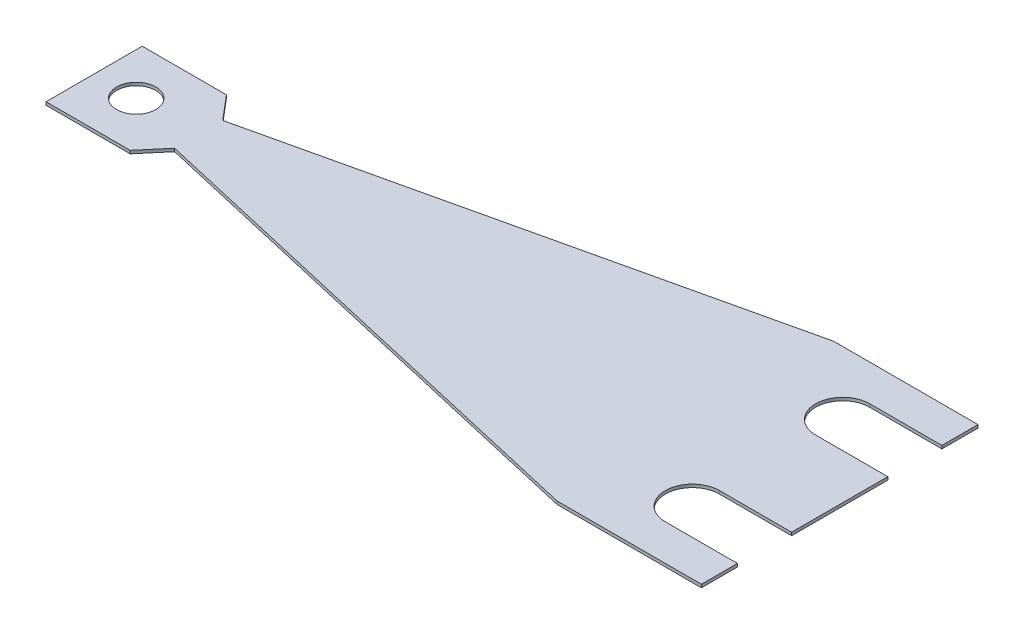
ISO-10303-21;
HEADER;
FILE_DESCRIPTION(('STEP AP214'),'2;1');
FILE_NAME('part.step','',(''),(''),'','','');
FILE_SCHEMA(('AUTOMOTIVE_DESIGN { 1 0 10303 214 1 1 1 1 }'));
ENDSEC;
DATA;
#1=APPLICATION_CONTEXT('core data for automotive mechanical design processes');
#2=APPLICATION_PROTOCOL_DEFINITION('international standard','automotive_design',2000,#1);
#3=PRODUCT_CONTEXT('',#1,'mechanical');
#4=PRODUCT('Part','Part','',(#3));
#5=PRODUCT_RELATED_PRODUCT_CATEGORY('part','',(#4));
#6=PRODUCT_DEFINITION_FORMATION('','',#4);
#7=PRODUCT_DEFINITION_CONTEXT('part definition',#1,'design');
#8=PRODUCT_DEFINITION('design','',#6,#7);
#9=PRODUCT_DEFINITION_SHAPE('','',#8);
#10=(LENGTH_UNIT() NAMED_UNIT(*) SI_UNIT(.MILLI.,.METRE.));
#11=(NAMED_UNIT(*) PLANE_ANGLE_UNIT() SI_UNIT($,.RADIAN.));
#12=(NAMED_UNIT(*) SI_UNIT($,.STERADIAN.) SOLID_ANGLE_UNIT());
#13=UNCERTAINTY_MEASURE_WITH_UNIT(LENGTH_MEASURE(1.E-05),#10,'distance_accuracy_value','');
#14=(GEOMETRIC_REPRESENTATION_CONTEXT(3) GLOBAL_UNCERTAINTY_ASSIGNED_CONTEXT((#13)) GLOBAL_UNIT_ASSIGNED_CONTEXT((#10,
#11,#12)) REPRESENTATION_CONTEXT('',''));
#15=CARTESIAN_POINT('',(0.,0.,0.));
#16=DIRECTION('',(0.,0.,1.));
#17=DIRECTION('',(1.,0.,0.));
#18=AXIS2_PLACEMENT_3D('',#15,#16,#17);
#19=CARTESIAN_POINT('',(0.,0.254,11.5));
#20=DIRECTION('',(-1.,0.,0.));
#21=DIRECTION('',(0.,0.,1.));
#22=AXIS2_PLACEMENT_3D('',#19,#20,#21);
#23=PLANE('',#22);
#24=DIRECTION('',(0.,0.,-1.));
#25=VECTOR('',#24,1.);
#26=CARTESIAN_POINT('',(0.,0.254,11.5));
#27=LINE('',#26,#25);
#28=CARTESIAN_POINT('',(0.,0.254,4.));
#29=VERTEX_POINT('',#28);
#30=CARTESIAN_POINT('',(0.,0.254,-4.));
#31=VERTEX_POINT('',#30);
#32=EDGE_CURVE('E247',#29,#31,#27,.T.);
#33=ORIENTED_EDGE('',*,*,#32,.F.);
#34=DIRECTION('',(0.,1.,0.));
#35=VECTOR('',#34,1.);
#36=CARTESIAN_POINT('',(0.,0.,4.));
#37=LINE('',#36,#35);
#38=CARTESIAN_POINT('',(0.,0.,4.));
#39=VERTEX_POINT('',#38);
#40=EDGE_CURVE('E193',#39,#29,#37,.T.);
#41=ORIENTED_EDGE('',*,*,#40,.F.);
#42=DIRECTION('',(0.,0.,-1.));
#43=VECTOR('',#42,1.);
#44=CARTESIAN_POINT('',(0.,0.,11.5));
#45=LINE('',#44,#43);
#46=CARTESIAN_POINT('',(0.,0.,-4.));
#47=VERTEX_POINT('',#46);
#48=EDGE_CURVE('E55',#39,#47,#45,.T.);
#49=ORIENTED_EDGE('',*,*,#48,.T.);
#50=DIRECTION('',(0.,1.,0.));
#51=VECTOR('',#50,1.);
#52=CARTESIAN_POINT('',(0.,0.,-4.));
#53=LINE('',#52,#51);
#54=EDGE_CURVE('E219',#47,#31,#53,.T.);
#55=ORIENTED_EDGE('',*,*,#54,.T.);
#56=EDGE_LOOP('',(#33,#41,#49,#55));
#57=FACE_BOUND('',#56,.T.);
#58=ADVANCED_FACE('F32',(#57),#23,.F.);
#59=CARTESIAN_POINT('',(0.,0.254,-8.5));
#60=VERTEX_POINT('',#59);
#61=CARTESIAN_POINT('',(0.,0.254,-11.5));
#62=VERTEX_POINT('',#61);
#63=EDGE_CURVE('E242',#60,#62,#27,.T.);
#64=ORIENTED_EDGE('',*,*,#63,.F.);
#65=DIRECTION('',(0.,1.,0.));
#66=VECTOR('',#65,1.);
#67=CARTESIAN_POINT('',(0.,0.,-8.5));
#68=LINE('',#67,#66);
#69=CARTESIAN_POINT('',(0.,0.,-8.5));
#70=VERTEX_POINT('',#69);
#71=EDGE_CURVE('E217',#70,#60,#68,.T.);
#72=ORIENTED_EDGE('',*,*,#71,.F.);
#73=CARTESIAN_POINT('',(0.,0.,-11.5));
#74=VERTEX_POINT('',#73);
#75=EDGE_CURVE('E266',#70,#74,#45,.T.);
#76=ORIENTED_EDGE('',*,*,#75,.T.);
#77=DIRECTION('',(0.,-1.,0.));
#78=VECTOR('',#77,1.);
#79=CARTESIAN_POINT('',(0.,0.254,-11.5));
#80=LINE('',#79,#78);
#81=EDGE_CURVE('E246',#62,#74,#80,.T.);
#82=ORIENTED_EDGE('',*,*,#81,.F.);
#83=EDGE_LOOP('',(#64,#72,#76,#82));
#84=FACE_BOUND('',#83,.T.);
#85=ADVANCED_FACE('F324',(#84),#23,.F.);
#86=CARTESIAN_POINT('',(0.,0.254,-11.5));
#87=DIRECTION('',(0.,0.,1.));
#88=DIRECTION('',(1.,0.,0.));
#89=AXIS2_PLACEMENT_3D('',#86,#87,#88);
#90=PLANE('',#89);
#91=DIRECTION('',(-1.,0.,0.));
#92=VECTOR('',#91,1.);
#93=CARTESIAN_POINT('',(0.,0.,-11.5));
#94=LINE('',#93,#92);
#95=CARTESIAN_POINT('',(-12.,0.,-11.5));
#96=VERTEX_POINT('',#95);
#97=EDGE_CURVE('E216',#74,#96,#94,.T.);
#98=ORIENTED_EDGE('',*,*,#97,.T.);
#99=DIRECTION('',(0.,-1.,0.));
#100=VECTOR('',#99,1.);
#101=CARTESIAN_POINT('',(-12.,0.254,-11.5));
#102=LINE('',#101,#100);
#103=CARTESIAN_POINT('',(-12.,0.254,-11.5));
#104=VERTEX_POINT('',#103);
#105=EDGE_CURVE('E11',#104,#96,#102,.T.);
#106=ORIENTED_EDGE('',*,*,#105,.F.);
#107=DIRECTION('',(-1.,0.,0.));
#108=VECTOR('',#107,1.);
#109=CARTESIAN_POINT('',(0.,0.254,-11.5));
#110=LINE('',#109,#108);
#111=EDGE_CURVE('E222',#62,#104,#110,.T.);
#112=ORIENTED_EDGE('',*,*,#111,.F.);
#113=ORIENTED_EDGE('',*,*,#81,.T.);
#114=EDGE_LOOP('',(#98,#106,#112,#113));
#115=FACE_BOUND('',#114,.T.);
#116=ADVANCED_FACE('F34',(#115),#90,.F.);
#117=CARTESIAN_POINT('',(-12.,0.254,-11.5));
#118=DIRECTION('',(0.224147692921427,0.,0.974555186614899));
#119=DIRECTION('',(0.9745551866149,0.,-0.224147692921427));
#120=AXIS2_PLACEMENT_3D('',#117,#118,#119);
#121=PLANE('',#120);
#122=DIRECTION('',(-0.9745551866149,0.,0.224147692921427));
#123=VECTOR('',#122,1.);
#124=CARTESIAN_POINT('',(-12.,0.,-11.5));
#125=LINE('',#124,#123);
#126=CARTESIAN_POINT('',(-53.304347826087,0.,-2.));
#127=VERTEX_POINT('',#126);
#128=EDGE_CURVE('E250',#96,#127,#125,.T.);
#129=ORIENTED_EDGE('',*,*,#128,.T.);
#130=DIRECTION('',(0.,-1.,0.));
#131=VECTOR('',#130,1.);
#132=CARTESIAN_POINT('',(-53.304347826087,0.254,-2.));
#133=LINE('',#132,#131);
#134=CARTESIAN_POINT('',(-53.304347826087,0.254,-2.));
#135=VERTEX_POINT('',#134);
#136=EDGE_CURVE('E40',#135,#127,#133,.T.);
#137=ORIENTED_EDGE('',*,*,#136,.F.);
#138=DIRECTION('',(-0.9745551866149,0.,0.224147692921427));
#139=VECTOR('',#138,1.);
#140=CARTESIAN_POINT('',(-12.,0.254,-11.5));
#141=LINE('',#140,#139);
#142=EDGE_CURVE('E225',#104,#135,#141,.T.);
#143=ORIENTED_EDGE('',*,*,#142,.F.);
#144=ORIENTED_EDGE('',*,*,#105,.T.);
#145=EDGE_LOOP('',(#129,#137,#143,#144));
#146=FACE_BOUND('',#145,.T.);
#147=ADVANCED_FACE('F317',(#146),#121,.F.);
#148=CARTESIAN_POINT('',(-53.304347826087,0.254,-2.));
#149=DIRECTION('',(-0.762756963467113,0.,0.64668525163516));
#150=DIRECTION('',(0.64668525163516,0.,0.762756963467113));
#151=AXIS2_PLACEMENT_3D('',#148,#149,#150);
#152=PLANE('',#151);
#153=DIRECTION('',(-0.64668525163516,0.,-0.762756963467113));
#154=VECTOR('',#153,1.);
#155=CARTESIAN_POINT('',(-53.304347826087,0.,-2.));
#156=LINE('',#155,#154);
#157=CARTESIAN_POINT('',(-55.,0.,-4.));
#158=VERTEX_POINT('',#157);
#159=EDGE_CURVE('E252',#127,#158,#156,.T.);
#160=ORIENTED_EDGE('',*,*,#159,.T.);
#161=DIRECTION('',(0.,-1.,0.));
#162=VECTOR('',#161,1.);
#163=CARTESIAN_POINT('',(-55.,0.254,-4.));
#164=LINE('',#163,#162);
#165=CARTESIAN_POINT('',(-55.,0.254,-4.));
#166=VERTEX_POINT('',#165);
#167=EDGE_CURVE('E288',#166,#158,#164,.T.);
#168=ORIENTED_EDGE('',*,*,#167,.F.);
#169=DIRECTION('',(-0.64668525163516,0.,-0.762756963467113));
#170=VECTOR('',#169,1.);
#171=CARTESIAN_POINT('',(-53.304347826087,0.254,-2.));
#172=LINE('',#171,#170);
#173=EDGE_CURVE('E228',#135,#166,#172,.T.);
#174=ORIENTED_EDGE('',*,*,#173,.F.);
#175=ORIENTED_EDGE('',*,*,#136,.T.);
#176=EDGE_LOOP('',(#160,#168,#174,#175));
#177=FACE_BOUND('',#176,.T.);
#178=ADVANCED_FACE('F295',(#177),#152,.F.);
#179=CARTESIAN_POINT('',(-55.,0.254,-4.));
#180=DIRECTION('',(0.,0.,1.));
#181=DIRECTION('',(1.,0.,0.));
#182=AXIS2_PLACEMENT_3D('',#179,#180,#181);
#183=PLANE('',#182);
#184=DIRECTION('',(-1.,0.,0.));
#185=VECTOR('',#184,1.);
#186=CARTESIAN_POINT('',(-55.,0.,-4.));
#187=LINE('',#186,#185);
#188=CARTESIAN_POINT('',(-62.,0.,-4.));
#189=VERTEX_POINT('',#188);
#190=EDGE_CURVE('E254',#158,#189,#187,.T.);
#191=ORIENTED_EDGE('',*,*,#190,.T.);
#192=DIRECTION('',(0.,-1.,0.));
#193=VECTOR('',#192,1.);
#194=CARTESIAN_POINT('',(-62.,0.254,-4.));
#195=LINE('',#194,#193);
#196=CARTESIAN_POINT('',(-62.,0.254,-4.));
#197=VERTEX_POINT('',#196);
#198=EDGE_CURVE('E285',#197,#189,#195,.T.);
#199=ORIENTED_EDGE('',*,*,#198,.F.);
#200=DIRECTION('',(-1.,0.,0.));
#201=VECTOR('',#200,1.);
#202=CARTESIAN_POINT('',(-55.,0.254,-4.));
#203=LINE('',#202,#201);
#204=EDGE_CURVE('E230',#166,#197,#203,.T.);
#205=ORIENTED_EDGE('',*,*,#204,.F.);
#206=ORIENTED_EDGE('',*,*,#167,.T.);
#207=EDGE_LOOP('',(#191,#199,#205,#206));
#208=FACE_BOUND('',#207,.T.);
#209=ADVANCED_FACE('F304',(#208),#183,.F.);
#210=CARTESIAN_POINT('',(-62.,0.254,-4.));
#211=DIRECTION('',(1.,0.,0.));
#212=DIRECTION('',(0.,0.,-1.));
#213=AXIS2_PLACEMENT_3D('',#210,#211,#212);
#214=PLANE('',#213);
#215=DIRECTION('',(0.,0.,1.));
#216=VECTOR('',#215,1.);
#217=CARTESIAN_POINT('',(-62.,0.,-4.));
#218=LINE('',#217,#216);
#219=CARTESIAN_POINT('',(-62.,0.,4.));
#220=VERTEX_POINT('',#219);
#221=EDGE_CURVE('E256',#189,#220,#218,.T.);
#222=ORIENTED_EDGE('',*,*,#221,.T.);
#223=DIRECTION('',(0.,-1.,0.));
#224=VECTOR('',#223,1.);
#225=CARTESIAN_POINT('',(-62.,0.254,4.));
#226=LINE('',#225,#224);
#227=CARTESIAN_POINT('',(-62.,0.254,4.));
#228=VERTEX_POINT('',#227);
#229=EDGE_CURVE('E282',#228,#220,#226,.T.);
#230=ORIENTED_EDGE('',*,*,#229,.F.);
#231=DIRECTION('',(0.,0.,1.));
#232=VECTOR('',#231,1.);
#233=CARTESIAN_POINT('',(-62.,0.254,-4.));
#234=LINE('',#233,#232);
#235=EDGE_CURVE('E232',#197,#228,#234,.T.);
#236=ORIENTED_EDGE('',*,*,#235,.F.);
#237=ORIENTED_EDGE('',*,*,#198,.T.);
#238=EDGE_LOOP('',(#222,#230,#236,#237));
#239=FACE_BOUND('',#238,.T.);
#240=ADVANCED_FACE('F308',(#239),#214,.F.);
#241=CARTESIAN_POINT('',(-55.,0.254,4.));
#242=DIRECTION('',(0.,0.,-1.));
#243=DIRECTION('',(-1.,0.,0.));
#244=AXIS2_PLACEMENT_3D('',#241,#242,#243);
#245=PLANE('',#244);
#246=DIRECTION('',(1.,0.,0.));
#247=VECTOR('',#246,1.);
#248=CARTESIAN_POINT('',(-55.,0.,4.));
#249=LINE('',#248,#247);
#250=CARTESIAN_POINT('',(-55.,0.,4.));
#251=VERTEX_POINT('',#250);
#252=EDGE_CURVE('E258',#220,#251,#249,.T.);
#253=ORIENTED_EDGE('',*,*,#252,.T.);
#254=DIRECTION('',(0.,-1.,0.));
#255=VECTOR('',#254,1.);
#256=CARTESIAN_POINT('',(-55.,0.254,4.));
#257=LINE('',#256,#255);
#258=CARTESIAN_POINT('',(-55.,0.254,4.));
#259=VERTEX_POINT('',#258);
#260=EDGE_CURVE('E279',#259,#251,#257,.T.);
#261=ORIENTED_EDGE('',*,*,#260,.F.);
#262=DIRECTION('',(1.,0.,0.));
#263=VECTOR('',#262,1.);
#264=CARTESIAN_POINT('',(-55.,0.254,4.));
#265=LINE('',#264,#263);
#266=EDGE_CURVE('E234',#228,#259,#265,.T.);
#267=ORIENTED_EDGE('',*,*,#266,.F.);
#268=ORIENTED_EDGE('',*,*,#229,.T.);
#269=EDGE_LOOP('',(#253,#261,#267,#268));
#270=FACE_BOUND('',#269,.T.);
#271=ADVANCED_FACE('F382',(#270),#245,.F.);
#272=CARTESIAN_POINT('',(-53.304347826087,0.254,2.00000000000001));
#273=DIRECTION('',(-0.762756963467111,0.,-0.646685251635162));
#274=DIRECTION('',(-0.646685251635162,0.,0.762756963467111));
#275=AXIS2_PLACEMENT_3D('',#272,#273,#274);
#276=PLANE('',#275);
#277=DIRECTION('',(0.646685251635162,0.,-0.76275696346711));
#278=VECTOR('',#277,1.);
#279=CARTESIAN_POINT('',(-53.304347826087,0.,2.00000000000001));
#280=LINE('',#279,#278);
#281=CARTESIAN_POINT('',(-53.304347826087,0.,2.00000000000001));
#282=VERTEX_POINT('',#281);
#283=EDGE_CURVE('E260',#251,#282,#280,.T.);
#284=ORIENTED_EDGE('',*,*,#283,.T.);
#285=DIRECTION('',(0.,-1.,0.));
#286=VECTOR('',#285,1.);
#287=CARTESIAN_POINT('',(-53.304347826087,0.254,2.00000000000001));
#288=LINE('',#287,#286);
#289=CARTESIAN_POINT('',(-53.304347826087,0.254,2.00000000000001));
#290=VERTEX_POINT('',#289);
#291=EDGE_CURVE('E276',#290,#282,#288,.T.);
#292=ORIENTED_EDGE('',*,*,#291,.F.);
#293=DIRECTION('',(0.646685251635162,0.,-0.76275696346711));
#294=VECTOR('',#293,1.);
#295=CARTESIAN_POINT('',(-53.304347826087,0.254,2.00000000000001));
#296=LINE('',#295,#294);
#297=EDGE_CURVE('E236',#259,#290,#296,.T.);
#298=ORIENTED_EDGE('',*,*,#297,.F.);
#299=ORIENTED_EDGE('',*,*,#260,.T.);
#300=EDGE_LOOP('',(#284,#292,#298,#299));
#301=FACE_BOUND('',#300,.T.);
#302=ADVANCED_FACE('F380',(#301),#276,.F.);
#303=CARTESIAN_POINT('',(-12.,0.254,11.5));
#304=DIRECTION('',(0.224147692921427,0.,-0.974555186614899));
#305=DIRECTION('',(-0.9745551866149,0.,-0.224147692921427));
#306=AXIS2_PLACEMENT_3D('',#303,#304,#305);
#307=PLANE('',#306);
#308=DIRECTION('',(0.9745551866149,0.,0.224147692921427));
#309=VECTOR('',#308,1.);
#310=CARTESIAN_POINT('',(-12.,0.,11.5));
#311=LINE('',#310,#309);
#312=CARTESIAN_POINT('',(-12.,0.,11.5));
#313=VERTEX_POINT('',#312);
#314=EDGE_CURVE('E262',#282,#313,#311,.T.);
#315=ORIENTED_EDGE('',*,*,#314,.T.);
#316=DIRECTION('',(0.,-1.,0.));
#317=VECTOR('',#316,1.);
#318=CARTESIAN_POINT('',(-12.,0.254,11.5));
#319=LINE('',#318,#317);
#320=CARTESIAN_POINT('',(-12.,0.254,11.5));
#321=VERTEX_POINT('',#320);
#322=EDGE_CURVE('E273',#321,#313,#319,.T.);
#323=ORIENTED_EDGE('',*,*,#322,.F.);
#324=DIRECTION('',(0.9745551866149,0.,0.224147692921427));
#325=VECTOR('',#324,1.);
#326=CARTESIAN_POINT('',(-12.,0.254,11.5));
#327=LINE('',#326,#325);
#328=EDGE_CURVE('E238',#290,#321,#327,.T.);
#329=ORIENTED_EDGE('',*,*,#328,.F.);
#330=ORIENTED_EDGE('',*,*,#291,.T.);
#331=EDGE_LOOP('',(#315,#323,#329,#330));
#332=FACE_BOUND('',#331,.T.);
#333=ADVANCED_FACE('F366',(#332),#307,.F.);
#334=CARTESIAN_POINT('',(0.,0.254,11.5));
#335=DIRECTION('',(0.,0.,-1.));
#336=DIRECTION('',(-1.,0.,0.));
#337=AXIS2_PLACEMENT_3D('',#334,#335,#336);
#338=PLANE('',#337);
#339=DIRECTION('',(1.,0.,0.));
#340=VECTOR('',#339,1.);
#341=CARTESIAN_POINT('',(0.,0.,11.5));
#342=LINE('',#341,#340);
#343=CARTESIAN_POINT('',(0.,0.,11.5));
#344=VERTEX_POINT('',#343);
#345=EDGE_CURVE('E264',#313,#344,#342,.T.);
#346=ORIENTED_EDGE('',*,*,#345,.T.);
#347=DIRECTION('',(0.,-1.,0.));
#348=VECTOR('',#347,1.);
#349=CARTESIAN_POINT('',(0.,0.254,11.5));
#350=LINE('',#349,#348);
#351=CARTESIAN_POINT('',(0.,0.254,11.5));
#352=VERTEX_POINT('',#351);
#353=EDGE_CURVE('E270',#352,#344,#350,.T.);
#354=ORIENTED_EDGE('',*,*,#353,.F.);
#355=DIRECTION('',(1.,0.,0.));
#356=VECTOR('',#355,1.);
#357=CARTESIAN_POINT('',(0.,0.254,11.5));
#358=LINE('',#357,#356);
#359=EDGE_CURVE('E240',#321,#352,#358,.T.);
#360=ORIENTED_EDGE('',*,*,#359,.F.);
#361=ORIENTED_EDGE('',*,*,#322,.T.);
#362=EDGE_LOOP('',(#346,#354,#360,#361));
#363=FACE_BOUND('',#362,.T.);
#364=ADVANCED_FACE('F358',(#363),#338,.F.);
#365=CARTESIAN_POINT('',(0.,0.,8.5));
#366=VERTEX_POINT('',#365);
#367=EDGE_CURVE('E226',#344,#366,#45,.T.);
#368=ORIENTED_EDGE('',*,*,#367,.T.);
#369=DIRECTION('',(0.,1.,0.));
#370=VECTOR('',#369,1.);
#371=CARTESIAN_POINT('',(0.,0.,8.5));
#372=LINE('',#371,#370);
#373=CARTESIAN_POINT('',(0.,0.254,8.5));
#374=VERTEX_POINT('',#373);
#375=EDGE_CURVE('E47',#366,#374,#372,.T.);
#376=ORIENTED_EDGE('',*,*,#375,.T.);
#377=EDGE_CURVE('E243',#352,#374,#27,.T.);
#378=ORIENTED_EDGE('',*,*,#377,.F.);
#379=ORIENTED_EDGE('',*,*,#353,.T.);
#380=EDGE_LOOP('',(#368,#376,#378,#379));
#381=FACE_BOUND('',#380,.T.);
#382=ADVANCED_FACE('F351',(#381),#23,.F.);
#383=CARTESIAN_POINT('',(-62.,0.254,-11.5));
#384=DIRECTION('',(0.,1.,0.));
#385=DIRECTION('',(0.,0.,1.));
#386=AXIS2_PLACEMENT_3D('',#383,#384,#385);
#387=PLANE('',#386);
#388=CARTESIAN_POINT('',(-58.5,0.254,0.));
#389=DIRECTION('',(0.,1.,0.));
#390=DIRECTION('',(0.,0.,1.));
#391=AXIS2_PLACEMENT_3D('',#388,#389,#390);
#392=CIRCLE('',#391,1.63);
#393=CARTESIAN_POINT('',(-58.5,0.254,1.63));
#394=VERTEX_POINT('',#393);
#395=EDGE_CURVE('E183',#394,#394,#392,.T.);
#396=ORIENTED_EDGE('',*,*,#395,.F.);
#397=EDGE_LOOP('',(#396));
#398=FACE_BOUND('',#397,.T.);
#399=DIRECTION('',(-1.,0.,0.));
#400=VECTOR('',#399,1.);
#401=CARTESIAN_POINT('',(-6.,0.254,4.));
#402=LINE('',#401,#400);
#403=CARTESIAN_POINT('',(-6.,0.254,4.));
#404=VERTEX_POINT('',#403);
#405=EDGE_CURVE('E177',#29,#404,#402,.T.);
#406=ORIENTED_EDGE('',*,*,#405,.F.);
#407=ORIENTED_EDGE('',*,*,#32,.T.);
#408=DIRECTION('',(1.,0.,0.));
#409=VECTOR('',#408,1.);
#410=CARTESIAN_POINT('',(-6.,0.254,-4.));
#411=LINE('',#410,#409);
#412=CARTESIAN_POINT('',(-6.,0.254,-4.));
#413=VERTEX_POINT('',#412);
#414=EDGE_CURVE('E209',#413,#31,#411,.T.);
#415=ORIENTED_EDGE('',*,*,#414,.F.);
#416=CARTESIAN_POINT('',(-6.,0.254,-6.25));
#417=DIRECTION('',(0.,1.,0.));
#418=DIRECTION('',(0.,0.,1.));
#419=AXIS2_PLACEMENT_3D('',#416,#417,#418);
#420=CIRCLE('',#419,2.25);
#421=CARTESIAN_POINT('',(-6.,0.254,-8.5));
#422=VERTEX_POINT('',#421);
#423=EDGE_CURVE('E192',#422,#413,#420,.T.);
#424=ORIENTED_EDGE('',*,*,#423,.F.);
#425=DIRECTION('',(-1.,0.,0.));
#426=VECTOR('',#425,1.);
#427=CARTESIAN_POINT('',(0.,0.254,-8.5));
#428=LINE('',#427,#426);
#429=EDGE_CURVE('E200',#60,#422,#428,.T.);
#430=ORIENTED_EDGE('',*,*,#429,.F.);
#431=ORIENTED_EDGE('',*,*,#63,.T.);
#432=ORIENTED_EDGE('',*,*,#111,.T.);
#433=ORIENTED_EDGE('',*,*,#142,.T.);
#434=ORIENTED_EDGE('',*,*,#173,.T.);
#435=ORIENTED_EDGE('',*,*,#204,.T.);
#436=ORIENTED_EDGE('',*,*,#235,.T.);
#437=ORIENTED_EDGE('',*,*,#266,.T.);
#438=ORIENTED_EDGE('',*,*,#297,.T.);
#439=ORIENTED_EDGE('',*,*,#328,.T.);
#440=ORIENTED_EDGE('',*,*,#359,.T.);
#441=ORIENTED_EDGE('',*,*,#377,.T.);
#442=DIRECTION('',(1.,0.,0.));
#443=VECTOR('',#442,1.);
#444=CARTESIAN_POINT('',(0.,0.254,8.5));
#445=LINE('',#444,#443);
#446=CARTESIAN_POINT('',(-6.,0.254,8.5));
#447=VERTEX_POINT('',#446);
#448=EDGE_CURVE('E180',#447,#374,#445,.T.);
#449=ORIENTED_EDGE('',*,*,#448,.F.);
#450=CARTESIAN_POINT('',(-6.,0.254,6.25));
#451=DIRECTION('',(0.,1.,0.));
#452=DIRECTION('',(0.,0.,-1.));
#453=AXIS2_PLACEMENT_3D('',#450,#451,#452);
#454=CIRCLE('',#453,2.25);
#455=EDGE_CURVE('E166',#404,#447,#454,.T.);
#456=ORIENTED_EDGE('',*,*,#455,.F.);
#457=EDGE_LOOP('',(#406,#407,#415,#424,#430,#431,#432,#433,#434,#435,#436,#437,#438,#439,#440,
#441,#449,#456));
#458=FACE_BOUND('',#457,.T.);
#459=ADVANCED_FACE('F313',(#398,#458),#387,.T.);
#460=CARTESIAN_POINT('',(-62.,0.,-11.5));
#461=DIRECTION('',(0.,1.,0.));
#462=DIRECTION('',(0.,0.,1.));
#463=AXIS2_PLACEMENT_3D('',#460,#461,#462);
#464=PLANE('',#463);
#465=CARTESIAN_POINT('',(-58.5,0.,0.));
#466=DIRECTION('',(0.,1.,0.));
#467=DIRECTION('',(0.,0.,1.));
#468=AXIS2_PLACEMENT_3D('',#465,#466,#467);
#469=CIRCLE('',#468,1.63);
#470=CARTESIAN_POINT('',(-58.5,0.,1.63));
#471=VERTEX_POINT('',#470);
#472=EDGE_CURVE('E188',#471,#471,#469,.T.);
#473=ORIENTED_EDGE('',*,*,#472,.T.);
#474=EDGE_LOOP('',(#473));
#475=FACE_BOUND('',#474,.T.);
#476=ORIENTED_EDGE('',*,*,#48,.F.);
#477=DIRECTION('',(-1.,0.,0.));
#478=VECTOR('',#477,1.);
#479=CARTESIAN_POINT('',(-6.,0.,4.));
#480=LINE('',#479,#478);
#481=CARTESIAN_POINT('',(-6.,0.,4.));
#482=VERTEX_POINT('',#481);
#483=EDGE_CURVE('E168',#39,#482,#480,.T.);
#484=ORIENTED_EDGE('',*,*,#483,.T.);
#485=CARTESIAN_POINT('',(-6.,0.,6.25));
#486=DIRECTION('',(0.,1.,0.));
#487=DIRECTION('',(0.,0.,-1.));
#488=AXIS2_PLACEMENT_3D('',#485,#486,#487);
#489=CIRCLE('',#488,2.25);
#490=CARTESIAN_POINT('',(-6.,0.,8.5));
#491=VERTEX_POINT('',#490);
#492=EDGE_CURVE('E163',#482,#491,#489,.T.);
#493=ORIENTED_EDGE('',*,*,#492,.T.);
#494=DIRECTION('',(1.,0.,0.));
#495=VECTOR('',#494,1.);
#496=CARTESIAN_POINT('',(0.,0.,8.5));
#497=LINE('',#496,#495);
#498=EDGE_CURVE('E170',#491,#366,#497,.T.);
#499=ORIENTED_EDGE('',*,*,#498,.T.);
#500=ORIENTED_EDGE('',*,*,#367,.F.);
#501=ORIENTED_EDGE('',*,*,#345,.F.);
#502=ORIENTED_EDGE('',*,*,#314,.F.);
#503=ORIENTED_EDGE('',*,*,#283,.F.);
#504=ORIENTED_EDGE('',*,*,#252,.F.);
#505=ORIENTED_EDGE('',*,*,#221,.F.);
#506=ORIENTED_EDGE('',*,*,#190,.F.);
#507=ORIENTED_EDGE('',*,*,#159,.F.);
#508=ORIENTED_EDGE('',*,*,#128,.F.);
#509=ORIENTED_EDGE('',*,*,#97,.F.);
#510=ORIENTED_EDGE('',*,*,#75,.F.);
#511=DIRECTION('',(-1.,0.,0.));
#512=VECTOR('',#511,1.);
#513=CARTESIAN_POINT('',(0.,0.,-8.5));
#514=LINE('',#513,#512);
#515=CARTESIAN_POINT('',(-6.,0.,-8.5));
#516=VERTEX_POINT('',#515);
#517=EDGE_CURVE('E203',#70,#516,#514,.T.);
#518=ORIENTED_EDGE('',*,*,#517,.T.);
#519=CARTESIAN_POINT('',(-6.,0.,-6.25));
#520=DIRECTION('',(0.,1.,0.));
#521=DIRECTION('',(0.,0.,1.));
#522=AXIS2_PLACEMENT_3D('',#519,#520,#521);
#523=CIRCLE('',#522,2.25);
#524=CARTESIAN_POINT('',(-6.,0.,-4.));
#525=VERTEX_POINT('',#524);
#526=EDGE_CURVE('E196',#516,#525,#523,.T.);
#527=ORIENTED_EDGE('',*,*,#526,.T.);
#528=DIRECTION('',(1.,0.,0.));
#529=VECTOR('',#528,1.);
#530=CARTESIAN_POINT('',(-6.,0.,-4.));
#531=LINE('',#530,#529);
#532=EDGE_CURVE('E199',#525,#47,#531,.T.);
#533=ORIENTED_EDGE('',*,*,#532,.T.);
#534=EDGE_LOOP('',(#476,#484,#493,#499,#500,#501,#502,#503,#504,#505,#506,#507,#508,#509,#510,
#518,#527,#533));
#535=FACE_BOUND('',#534,.T.);
#536=ADVANCED_FACE('F176',(#475,#535),#464,.F.);
#537=CARTESIAN_POINT('',(-6.,0.,-6.25));
#538=DIRECTION('',(0.,1.,0.));
#539=DIRECTION('',(0.,0.,1.));
#540=AXIS2_PLACEMENT_3D('',#537,#538,#539);
#541=CYLINDRICAL_SURFACE('',#540,2.25);
#542=ORIENTED_EDGE('',*,*,#423,.T.);
#543=DIRECTION('',(0.,1.,0.));
#544=VECTOR('',#543,1.);
#545=CARTESIAN_POINT('',(-6.,0.,-4.));
#546=LINE('',#545,#544);
#547=EDGE_CURVE('E206',#525,#413,#546,.T.);
#548=ORIENTED_EDGE('',*,*,#547,.F.);
#549=ORIENTED_EDGE('',*,*,#526,.F.);
#550=DIRECTION('',(0.,1.,0.));
#551=VECTOR('',#550,1.);
#552=CARTESIAN_POINT('',(-6.,0.,-8.5));
#553=LINE('',#552,#551);
#554=EDGE_CURVE('E214',#516,#422,#553,.T.);
#555=ORIENTED_EDGE('',*,*,#554,.T.);
#556=EDGE_LOOP('',(#542,#548,#549,#555));
#557=FACE_BOUND('',#556,.T.);
#558=ADVANCED_FACE('F331',(#557),#541,.F.);
#559=CARTESIAN_POINT('',(0.,0.,-8.5));
#560=DIRECTION('',(0.,0.,-1.));
#561=DIRECTION('',(-1.,0.,0.));
#562=AXIS2_PLACEMENT_3D('',#559,#560,#561);
#563=PLANE('',#562);
#564=ORIENTED_EDGE('',*,*,#429,.T.);
#565=ORIENTED_EDGE('',*,*,#554,.F.);
#566=ORIENTED_EDGE('',*,*,#517,.F.);
#567=ORIENTED_EDGE('',*,*,#71,.T.);
#568=EDGE_LOOP('',(#564,#565,#566,#567));
#569=FACE_BOUND('',#568,.T.);
#570=ADVANCED_FACE('F327',(#569),#563,.F.);
#571=CARTESIAN_POINT('',(-6.,0.,-4.));
#572=DIRECTION('',(0.,0.,1.));
#573=DIRECTION('',(1.,0.,0.));
#574=AXIS2_PLACEMENT_3D('',#571,#572,#573);
#575=PLANE('',#574);
#576=ORIENTED_EDGE('',*,*,#414,.T.);
#577=ORIENTED_EDGE('',*,*,#54,.F.);
#578=ORIENTED_EDGE('',*,*,#532,.F.);
#579=ORIENTED_EDGE('',*,*,#547,.T.);
#580=EDGE_LOOP('',(#576,#577,#578,#579));
#581=FACE_BOUND('',#580,.T.);
#582=ADVANCED_FACE('F335',(#581),#575,.F.);
#583=CARTESIAN_POINT('',(-6.,0.,6.25));
#584=DIRECTION('',(0.,1.,0.));
#585=DIRECTION('',(0.,0.,1.));
#586=AXIS2_PLACEMENT_3D('',#583,#584,#585);
#587=CYLINDRICAL_SURFACE('',#586,2.25);
#588=ORIENTED_EDGE('',*,*,#455,.T.);
#589=DIRECTION('',(0.,1.,0.));
#590=VECTOR('',#589,1.);
#591=CARTESIAN_POINT('',(-6.,0.,8.5));
#592=LINE('',#591,#590);
#593=EDGE_CURVE('E160',#491,#447,#592,.T.);
#594=ORIENTED_EDGE('',*,*,#593,.F.);
#595=ORIENTED_EDGE('',*,*,#492,.F.);
#596=DIRECTION('',(0.,1.,0.));
#597=VECTOR('',#596,1.);
#598=CARTESIAN_POINT('',(-6.,0.,4.));
#599=LINE('',#598,#597);
#600=EDGE_CURVE('E190',#482,#404,#599,.T.);
#601=ORIENTED_EDGE('',*,*,#600,.T.);
#602=EDGE_LOOP('',(#588,#594,#595,#601));
#603=FACE_BOUND('',#602,.T.);
#604=ADVANCED_FACE('F161',(#603),#587,.F.);
#605=CARTESIAN_POINT('',(-6.,0.,4.));
#606=DIRECTION('',(0.,0.,-1.));
#607=DIRECTION('',(-1.,0.,0.));
#608=AXIS2_PLACEMENT_3D('',#605,#606,#607);
#609=PLANE('',#608);
#610=ORIENTED_EDGE('',*,*,#405,.T.);
#611=ORIENTED_EDGE('',*,*,#600,.F.);
#612=ORIENTED_EDGE('',*,*,#483,.F.);
#613=ORIENTED_EDGE('',*,*,#40,.T.);
#614=EDGE_LOOP('',(#610,#611,#612,#613));
#615=FACE_BOUND('',#614,.T.);
#616=ADVANCED_FACE('F338',(#615),#609,.F.);
#617=CARTESIAN_POINT('',(0.,0.,8.5));
#618=DIRECTION('',(0.,0.,1.));
#619=DIRECTION('',(1.,0.,0.));
#620=AXIS2_PLACEMENT_3D('',#617,#618,#619);
#621=PLANE('',#620);
#622=ORIENTED_EDGE('',*,*,#448,.T.);
#623=ORIENTED_EDGE('',*,*,#375,.F.);
#624=ORIENTED_EDGE('',*,*,#498,.F.);
#625=ORIENTED_EDGE('',*,*,#593,.T.);
#626=EDGE_LOOP('',(#622,#623,#624,#625));
#627=FACE_BOUND('',#626,.T.);
#628=ADVANCED_FACE('F171',(#627),#621,.F.);
#629=CARTESIAN_POINT('',(-58.5,0.,0.));
#630=DIRECTION('',(0.,1.,0.));
#631=DIRECTION('',(0.,0.,1.));
#632=AXIS2_PLACEMENT_3D('',#629,#630,#631);
#633=CYLINDRICAL_SURFACE('',#632,1.63);
#634=ORIENTED_EDGE('',*,*,#472,.F.);
#635=EDGE_LOOP('',(#634));
#636=FACE_BOUND('',#635,.T.);
#637=ORIENTED_EDGE('',*,*,#395,.T.);
#638=EDGE_LOOP('',(#637));
#639=FACE_BOUND('',#638,.T.);
#640=ADVANCED_FACE('F345',(#636,#639),#633,.F.);
#641=CLOSED_SHELL('',(#58,#85,#116,#147,#178,#209,#240,#271,#302,#333,#364,#382,#459,#536,#558,
#570,#582,#604,#616,#628,#640));
#642=MANIFOLD_SOLID_BREP('B2',#641);
#643=ADVANCED_BREP_SHAPE_REPRESENTATION('',(#18,#642),#14);
#644=SHAPE_DEFINITION_REPRESENTATION(#9,#643);
ENDSEC;
END-ISO-10303-21;
